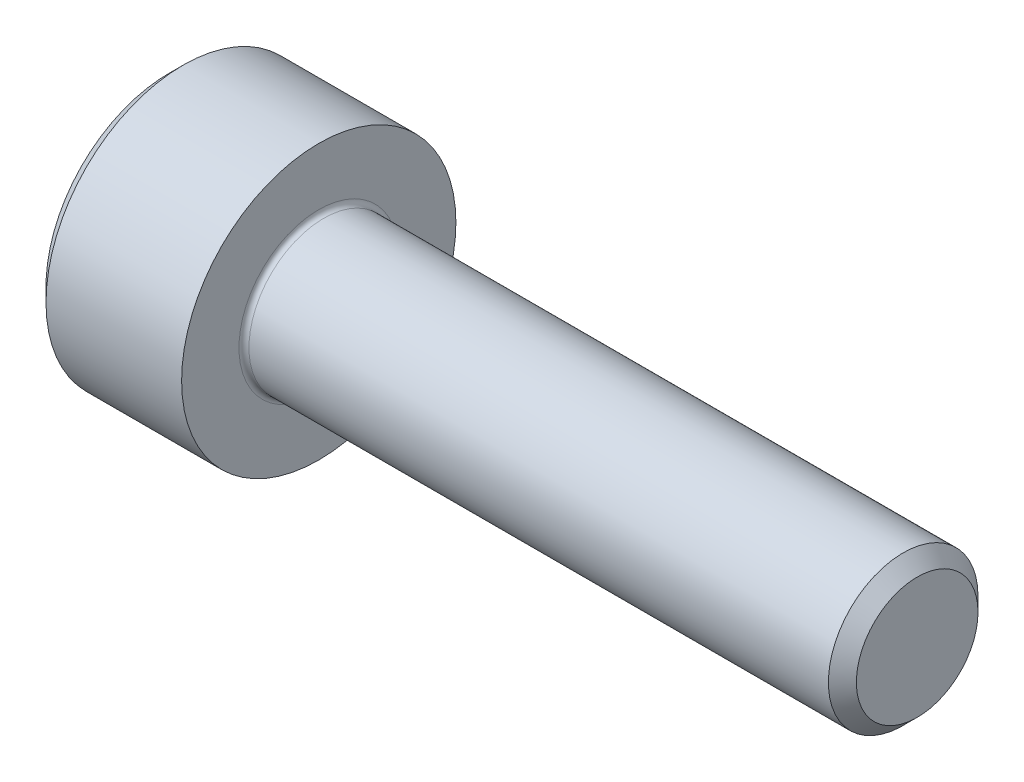
ISO-10303-21;
HEADER;
FILE_DESCRIPTION(('STEP AP214'),'2;1');
FILE_NAME('part.step','',(''),(''),'','','');
FILE_SCHEMA(('AUTOMOTIVE_DESIGN { 1 0 10303 214 1 1 1 1 }'));
ENDSEC;
DATA;
#1=APPLICATION_CONTEXT('core data for automotive mechanical design processes');
#2=APPLICATION_PROTOCOL_DEFINITION('international standard','automotive_design',2000,#1);
#3=PRODUCT_CONTEXT('',#1,'mechanical');
#4=PRODUCT('Part','Part','',(#3));
#5=PRODUCT_RELATED_PRODUCT_CATEGORY('part','',(#4));
#6=PRODUCT_DEFINITION_FORMATION('','',#4);
#7=PRODUCT_DEFINITION_CONTEXT('part definition',#1,'design');
#8=PRODUCT_DEFINITION('design','',#6,#7);
#9=PRODUCT_DEFINITION_SHAPE('','',#8);
#10=(LENGTH_UNIT() NAMED_UNIT(*) SI_UNIT(.MILLI.,.METRE.));
#11=(NAMED_UNIT(*) PLANE_ANGLE_UNIT() SI_UNIT($,.RADIAN.));
#12=(NAMED_UNIT(*) SI_UNIT($,.STERADIAN.) SOLID_ANGLE_UNIT());
#13=UNCERTAINTY_MEASURE_WITH_UNIT(LENGTH_MEASURE(1.E-05),#10,'distance_accuracy_value','');
#14=(GEOMETRIC_REPRESENTATION_CONTEXT(3) GLOBAL_UNCERTAINTY_ASSIGNED_CONTEXT((#13)) GLOBAL_UNIT_ASSIGNED_CONTEXT((#10,
#11,#12)) REPRESENTATION_CONTEXT('',''));
#15=CARTESIAN_POINT('',(0.,0.,0.));
#16=DIRECTION('',(0.,0.,1.));
#17=DIRECTION('',(1.,0.,0.));
#18=AXIS2_PLACEMENT_3D('',#15,#16,#17);
#19=CARTESIAN_POINT('',(1.3,0.,0.));
#20=DIRECTION('',(-1.,0.,0.));
#21=DIRECTION('',(0.,0.,1.));
#22=AXIS2_PLACEMENT_3D('',#19,#20,#21);
#23=PLANE('',#22);
#24=DIRECTION('',(0.,-1.,0.));
#25=VECTOR('',#24,1.);
#26=CARTESIAN_POINT('',(1.3,0.739008344562716,-1.28));
#27=LINE('',#26,#25);
#28=CARTESIAN_POINT('',(1.3,0.739008344562716,-1.28));
#29=VERTEX_POINT('',#28);
#30=CARTESIAN_POINT('',(1.3,0.,-1.28));
#31=VERTEX_POINT('',#30);
#32=EDGE_CURVE('E234',#29,#31,#27,.T.);
#33=ORIENTED_EDGE('',*,*,#32,.T.);
#34=CARTESIAN_POINT('',(1.3,0.,0.));
#35=DIRECTION('',(1.,0.,0.));
#36=DIRECTION('',(0.,0.,-1.));
#37=AXIS2_PLACEMENT_3D('',#34,#35,#36);
#38=CIRCLE('',#37,1.28);
#39=CARTESIAN_POINT('',(1.3,1.10851251684408,-0.640000000000004));
#40=VERTEX_POINT('',#39);
#41=EDGE_CURVE('E63',#31,#40,#38,.T.);
#42=ORIENTED_EDGE('',*,*,#41,.T.);
#43=DIRECTION('',(0.,-0.500000000000003,-0.866025403784437));
#44=VECTOR('',#43,1.);
#45=CARTESIAN_POINT('',(1.3,1.47801668912544,0.));
#46=LINE('',#45,#44);
#47=EDGE_CURVE('E278',#40,#29,#46,.T.);
#48=ORIENTED_EDGE('',*,*,#47,.T.);
#49=EDGE_LOOP('',(#33,#42,#48));
#50=FACE_BOUND('',#49,.T.);
#51=ADVANCED_FACE('F47',(#50),#23,.T.);
#52=CARTESIAN_POINT('',(1.3,1.47801668912544,0.));
#53=VERTEX_POINT('',#52);
#54=EDGE_CURVE('E274',#53,#40,#46,.T.);
#55=ORIENTED_EDGE('',*,*,#54,.T.);
#56=CARTESIAN_POINT('',(1.3,1.10851251684408,0.639999999999998));
#57=VERTEX_POINT('',#56);
#58=EDGE_CURVE('E223',#40,#57,#38,.T.);
#59=ORIENTED_EDGE('',*,*,#58,.T.);
#60=DIRECTION('',(0.,0.499999999999998,-0.86602540378444));
#61=VECTOR('',#60,1.);
#62=CARTESIAN_POINT('',(1.3,0.73900834456272,1.28));
#63=LINE('',#62,#61);
#64=EDGE_CURVE('E283',#57,#53,#63,.T.);
#65=ORIENTED_EDGE('',*,*,#64,.T.);
#66=EDGE_LOOP('',(#55,#59,#65));
#67=FACE_BOUND('',#66,.T.);
#68=ADVANCED_FACE('F139',(#67),#23,.T.);
#69=CARTESIAN_POINT('',(1.3,0.73900834456272,1.28));
#70=VERTEX_POINT('',#69);
#71=EDGE_CURVE('E279',#70,#57,#63,.T.);
#72=ORIENTED_EDGE('',*,*,#71,.T.);
#73=CARTESIAN_POINT('',(1.3,0.,1.28));
#74=VERTEX_POINT('',#73);
#75=EDGE_CURVE('E302',#57,#74,#38,.T.);
#76=ORIENTED_EDGE('',*,*,#75,.T.);
#77=DIRECTION('',(0.,1.,0.));
#78=VECTOR('',#77,1.);
#79=CARTESIAN_POINT('',(1.3,-0.739008344562722,1.28));
#80=LINE('',#79,#78);
#81=EDGE_CURVE('E288',#74,#70,#80,.T.);
#82=ORIENTED_EDGE('',*,*,#81,.T.);
#83=EDGE_LOOP('',(#72,#76,#82));
#84=FACE_BOUND('',#83,.T.);
#85=ADVANCED_FACE('F144',(#84),#23,.T.);
#86=CARTESIAN_POINT('',(1.3,-0.739008344562722,1.28));
#87=VERTEX_POINT('',#86);
#88=EDGE_CURVE('E284',#87,#74,#80,.T.);
#89=ORIENTED_EDGE('',*,*,#88,.T.);
#90=CARTESIAN_POINT('',(1.3,-1.10851251684408,0.640000000000001));
#91=VERTEX_POINT('',#90);
#92=EDGE_CURVE('E308',#74,#91,#38,.T.);
#93=ORIENTED_EDGE('',*,*,#92,.T.);
#94=DIRECTION('',(0.,0.5,0.866025403784438));
#95=VECTOR('',#94,1.);
#96=CARTESIAN_POINT('',(1.3,-1.47801668912544,0.));
#97=LINE('',#96,#95);
#98=EDGE_CURVE('E293',#91,#87,#97,.T.);
#99=ORIENTED_EDGE('',*,*,#98,.T.);
#100=EDGE_LOOP('',(#89,#93,#99));
#101=FACE_BOUND('',#100,.T.);
#102=ADVANCED_FACE('F323',(#101),#23,.T.);
#103=CARTESIAN_POINT('',(1.3,-1.47801668912544,0.));
#104=VERTEX_POINT('',#103);
#105=EDGE_CURVE('E289',#104,#91,#97,.T.);
#106=ORIENTED_EDGE('',*,*,#105,.T.);
#107=CARTESIAN_POINT('',(1.3,-1.10851251684408,-0.639999999999998));
#108=VERTEX_POINT('',#107);
#109=EDGE_CURVE('E304',#91,#108,#38,.T.);
#110=ORIENTED_EDGE('',*,*,#109,.T.);
#111=DIRECTION('',(0.,-0.499999999999999,0.86602540378444));
#112=VECTOR('',#111,1.);
#113=CARTESIAN_POINT('',(1.3,-0.739008344562726,-1.28));
#114=LINE('',#113,#112);
#115=EDGE_CURVE('E252',#108,#104,#114,.T.);
#116=ORIENTED_EDGE('',*,*,#115,.T.);
#117=EDGE_LOOP('',(#106,#110,#116));
#118=FACE_BOUND('',#117,.T.);
#119=ADVANCED_FACE('F137',(#118),#23,.T.);
#120=CARTESIAN_POINT('',(3.,0.,0.));
#121=DIRECTION('',(-1.,0.,0.));
#122=DIRECTION('',(0.,0.,1.));
#123=AXIS2_PLACEMENT_3D('',#120,#121,#122);
#124=CYLINDRICAL_SURFACE('',#123,2.75);
#125=CARTESIAN_POINT('',(0.28050000000001,0.,0.));
#126=DIRECTION('',(1.,0.,0.));
#127=DIRECTION('',(0.,0.,-1.));
#128=AXIS2_PLACEMENT_3D('',#125,#126,#127);
#129=CIRCLE('',#128,2.75);
#130=CARTESIAN_POINT('',(0.28050000000001,0.,-2.75));
#131=VERTEX_POINT('',#130);
#132=EDGE_CURVE('E206',#131,#131,#129,.T.);
#133=ORIENTED_EDGE('',*,*,#132,.T.);
#134=EDGE_LOOP('',(#133));
#135=FACE_BOUND('',#134,.T.);
#136=CARTESIAN_POINT('',(3.,0.,0.));
#137=DIRECTION('',(-1.,0.,0.));
#138=DIRECTION('',(0.,0.,-1.));
#139=AXIS2_PLACEMENT_3D('',#136,#137,#138);
#140=CIRCLE('',#139,2.75);
#141=CARTESIAN_POINT('',(3.,0.,-2.75));
#142=VERTEX_POINT('',#141);
#143=EDGE_CURVE('E224',#142,#142,#140,.T.);
#144=ORIENTED_EDGE('',*,*,#143,.T.);
#145=EDGE_LOOP('',(#144));
#146=FACE_BOUND('',#145,.T.);
#147=ADVANCED_FACE('F174',(#135,#146),#124,.T.);
#148=CARTESIAN_POINT('',(3.,0.,0.));
#149=DIRECTION('',(1.,0.,0.));
#150=DIRECTION('',(0.,0.,-1.));
#151=AXIS2_PLACEMENT_3D('',#148,#149,#150);
#152=PLANE('',#151);
#153=CARTESIAN_POINT('',(3.,0.,0.));
#154=DIRECTION('',(1.,0.,0.));
#155=DIRECTION('',(0.,0.,-1.));
#156=AXIS2_PLACEMENT_3D('',#153,#154,#155);
#157=CIRCLE('',#156,1.6);
#158=CARTESIAN_POINT('',(3.,0.,-1.6));
#159=VERTEX_POINT('',#158);
#160=EDGE_CURVE('E11',#159,#159,#157,.F.);
#161=ORIENTED_EDGE('',*,*,#160,.T.);
#162=EDGE_LOOP('',(#161));
#163=FACE_BOUND('',#162,.T.);
#164=ORIENTED_EDGE('',*,*,#143,.F.);
#165=EDGE_LOOP('',(#164));
#166=FACE_BOUND('',#165,.T.);
#167=ADVANCED_FACE('F171',(#163,#166),#152,.T.);
#168=CARTESIAN_POINT('',(0.,0.,0.));
#169=DIRECTION('',(1.,0.,0.));
#170=DIRECTION('',(0.,0.,-1.));
#171=AXIS2_PLACEMENT_3D('',#168,#169,#170);
#172=PLANE('',#171);
#173=CARTESIAN_POINT('',(0.,0.,0.));
#174=DIRECTION('',(1.,0.,0.));
#175=DIRECTION('',(0.,0.,-1.));
#176=AXIS2_PLACEMENT_3D('',#173,#174,#175);
#177=CIRCLE('',#176,2.4695);
#178=CARTESIAN_POINT('',(0.,0.,-2.4695));
#179=VERTEX_POINT('',#178);
#180=EDGE_CURVE('E212',#179,#179,#177,.F.);
#181=ORIENTED_EDGE('',*,*,#180,.T.);
#182=EDGE_LOOP('',(#181));
#183=FACE_BOUND('',#182,.T.);
#184=DIRECTION('',(0.,0.5,0.866025403784438));
#185=VECTOR('',#184,1.);
#186=CARTESIAN_POINT('',(0.,-1.47801668912544,0.));
#187=LINE('',#186,#185);
#188=CARTESIAN_POINT('',(0.,-1.47801668912544,0.));
#189=VERTEX_POINT('',#188);
#190=CARTESIAN_POINT('',(0.,-0.739008344562722,1.28));
#191=VERTEX_POINT('',#190);
#192=EDGE_CURVE('E265',#189,#191,#187,.T.);
#193=ORIENTED_EDGE('',*,*,#192,.F.);
#194=DIRECTION('',(0.,-0.499999999999999,0.86602540378444));
#195=VECTOR('',#194,1.);
#196=CARTESIAN_POINT('',(0.,-0.739008344562726,-1.28));
#197=LINE('',#196,#195);
#198=CARTESIAN_POINT('',(0.,-0.739008344562726,-1.28));
#199=VERTEX_POINT('',#198);
#200=EDGE_CURVE('E71',#199,#189,#197,.T.);
#201=ORIENTED_EDGE('',*,*,#200,.F.);
#202=DIRECTION('',(0.,-1.,0.));
#203=VECTOR('',#202,1.);
#204=CARTESIAN_POINT('',(0.,0.739008344562716,-1.28));
#205=LINE('',#204,#203);
#206=CARTESIAN_POINT('',(0.,0.739008344562716,-1.28));
#207=VERTEX_POINT('',#206);
#208=EDGE_CURVE('E248',#207,#199,#205,.T.);
#209=ORIENTED_EDGE('',*,*,#208,.F.);
#210=DIRECTION('',(0.,-0.500000000000003,-0.866025403784437));
#211=VECTOR('',#210,1.);
#212=CARTESIAN_POINT('',(0.,1.47801668912544,0.));
#213=LINE('',#212,#211);
#214=CARTESIAN_POINT('',(0.,1.47801668912544,0.));
#215=VERTEX_POINT('',#214);
#216=EDGE_CURVE('E253',#215,#207,#213,.T.);
#217=ORIENTED_EDGE('',*,*,#216,.F.);
#218=DIRECTION('',(0.,0.499999999999998,-0.86602540378444));
#219=VECTOR('',#218,1.);
#220=CARTESIAN_POINT('',(0.,0.73900834456272,1.28));
#221=LINE('',#220,#219);
#222=CARTESIAN_POINT('',(0.,0.73900834456272,1.28));
#223=VERTEX_POINT('',#222);
#224=EDGE_CURVE('E257',#223,#215,#221,.T.);
#225=ORIENTED_EDGE('',*,*,#224,.F.);
#226=DIRECTION('',(0.,1.,0.));
#227=VECTOR('',#226,1.);
#228=CARTESIAN_POINT('',(0.,-0.739008344562722,1.28));
#229=LINE('',#228,#227);
#230=EDGE_CURVE('E261',#191,#223,#229,.T.);
#231=ORIENTED_EDGE('',*,*,#230,.F.);
#232=EDGE_LOOP('',(#193,#201,#209,#217,#225,#231));
#233=FACE_BOUND('',#232,.T.);
#234=ADVANCED_FACE('F170',(#183,#233),#172,.F.);
#235=CARTESIAN_POINT('',(1.3,-0.739008344562726,-1.28));
#236=DIRECTION('',(0.,-0.86602540378444,-0.499999999999999));
#237=DIRECTION('',(0.,0.499999999999999,-0.86602540378444));
#238=AXIS2_PLACEMENT_3D('',#235,#236,#237);
#239=PLANE('',#238);
#240=ORIENTED_EDGE('',*,*,#200,.T.);
#241=DIRECTION('',(-1.,0.,0.));
#242=VECTOR('',#241,1.);
#243=CARTESIAN_POINT('',(1.3,-1.47801668912544,0.));
#244=LINE('',#243,#242);
#245=EDGE_CURVE('E230',#104,#189,#244,.T.);
#246=ORIENTED_EDGE('',*,*,#245,.F.);
#247=ORIENTED_EDGE('',*,*,#115,.F.);
#248=CARTESIAN_POINT('',(1.3,-0.739008344562726,-1.28));
#249=VERTEX_POINT('',#248);
#250=EDGE_CURVE('E294',#249,#108,#114,.T.);
#251=ORIENTED_EDGE('',*,*,#250,.F.);
#252=DIRECTION('',(-1.,0.,0.));
#253=VECTOR('',#252,1.);
#254=CARTESIAN_POINT('',(1.3,-0.739008344562726,-1.28));
#255=LINE('',#254,#253);
#256=EDGE_CURVE('E229',#249,#199,#255,.T.);
#257=ORIENTED_EDGE('',*,*,#256,.T.);
#258=EDGE_LOOP('',(#240,#246,#247,#251,#257));
#259=FACE_BOUND('',#258,.T.);
#260=ADVANCED_FACE('F152',(#259),#239,.F.);
#261=CARTESIAN_POINT('',(1.3,0.739008344562716,-1.28));
#262=DIRECTION('',(0.,0.,-1.));
#263=DIRECTION('',(-1.,0.,0.));
#264=AXIS2_PLACEMENT_3D('',#261,#262,#263);
#265=PLANE('',#264);
#266=ORIENTED_EDGE('',*,*,#208,.T.);
#267=ORIENTED_EDGE('',*,*,#256,.F.);
#268=EDGE_CURVE('E273',#31,#249,#27,.T.);
#269=ORIENTED_EDGE('',*,*,#268,.F.);
#270=ORIENTED_EDGE('',*,*,#32,.F.);
#271=DIRECTION('',(-1.,0.,0.));
#272=VECTOR('',#271,1.);
#273=CARTESIAN_POINT('',(1.3,0.739008344562716,-1.28));
#274=LINE('',#273,#272);
#275=EDGE_CURVE('E243',#29,#207,#274,.T.);
#276=ORIENTED_EDGE('',*,*,#275,.T.);
#277=EDGE_LOOP('',(#266,#267,#269,#270,#276));
#278=FACE_BOUND('',#277,.T.);
#279=ADVANCED_FACE('F148',(#278),#265,.F.);
#280=CARTESIAN_POINT('',(1.3,1.47801668912544,0.));
#281=DIRECTION('',(0.,0.866025403784437,-0.500000000000003));
#282=DIRECTION('',(0.,0.500000000000003,0.866025403784437));
#283=AXIS2_PLACEMENT_3D('',#280,#281,#282);
#284=PLANE('',#283);
#285=ORIENTED_EDGE('',*,*,#216,.T.);
#286=ORIENTED_EDGE('',*,*,#275,.F.);
#287=ORIENTED_EDGE('',*,*,#47,.F.);
#288=ORIENTED_EDGE('',*,*,#54,.F.);
#289=DIRECTION('',(-1.,0.,0.));
#290=VECTOR('',#289,1.);
#291=CARTESIAN_POINT('',(1.3,1.47801668912544,0.));
#292=LINE('',#291,#290);
#293=EDGE_CURVE('E240',#53,#215,#292,.T.);
#294=ORIENTED_EDGE('',*,*,#293,.T.);
#295=EDGE_LOOP('',(#285,#286,#287,#288,#294));
#296=FACE_BOUND('',#295,.T.);
#297=ADVANCED_FACE('F151',(#296),#284,.F.);
#298=CARTESIAN_POINT('',(1.3,0.73900834456272,1.28));
#299=DIRECTION('',(0.,0.86602540378444,0.499999999999998));
#300=DIRECTION('',(0.,-0.499999999999998,0.86602540378444));
#301=AXIS2_PLACEMENT_3D('',#298,#299,#300);
#302=PLANE('',#301);
#303=ORIENTED_EDGE('',*,*,#224,.T.);
#304=ORIENTED_EDGE('',*,*,#293,.F.);
#305=ORIENTED_EDGE('',*,*,#64,.F.);
#306=ORIENTED_EDGE('',*,*,#71,.F.);
#307=DIRECTION('',(-1.,0.,0.));
#308=VECTOR('',#307,1.);
#309=CARTESIAN_POINT('',(1.3,0.73900834456272,1.28));
#310=LINE('',#309,#308);
#311=EDGE_CURVE('E237',#70,#223,#310,.T.);
#312=ORIENTED_EDGE('',*,*,#311,.T.);
#313=EDGE_LOOP('',(#303,#304,#305,#306,#312));
#314=FACE_BOUND('',#313,.T.);
#315=ADVANCED_FACE('F156',(#314),#302,.F.);
#316=CARTESIAN_POINT('',(1.3,-0.739008344562722,1.28));
#317=DIRECTION('',(0.,0.,1.));
#318=DIRECTION('',(1.,0.,0.));
#319=AXIS2_PLACEMENT_3D('',#316,#317,#318);
#320=PLANE('',#319);
#321=ORIENTED_EDGE('',*,*,#230,.T.);
#322=ORIENTED_EDGE('',*,*,#311,.F.);
#323=ORIENTED_EDGE('',*,*,#81,.F.);
#324=ORIENTED_EDGE('',*,*,#88,.F.);
#325=DIRECTION('',(-1.,0.,0.));
#326=VECTOR('',#325,1.);
#327=CARTESIAN_POINT('',(1.3,-0.739008344562722,1.28));
#328=LINE('',#327,#326);
#329=EDGE_CURVE('E233',#87,#191,#328,.T.);
#330=ORIENTED_EDGE('',*,*,#329,.T.);
#331=EDGE_LOOP('',(#321,#322,#323,#324,#330));
#332=FACE_BOUND('',#331,.T.);
#333=ADVANCED_FACE('F160',(#332),#320,.F.);
#334=CARTESIAN_POINT('',(1.3,-1.47801668912544,0.));
#335=DIRECTION('',(0.,-0.866025403784438,0.500000000000001));
#336=DIRECTION('',(0.,-0.500000000000001,-0.866025403784438));
#337=AXIS2_PLACEMENT_3D('',#334,#335,#336);
#338=PLANE('',#337);
#339=ORIENTED_EDGE('',*,*,#192,.T.);
#340=ORIENTED_EDGE('',*,*,#329,.F.);
#341=ORIENTED_EDGE('',*,*,#98,.F.);
#342=ORIENTED_EDGE('',*,*,#105,.F.);
#343=ORIENTED_EDGE('',*,*,#245,.T.);
#344=EDGE_LOOP('',(#339,#340,#341,#342,#343));
#345=FACE_BOUND('',#344,.T.);
#346=ADVANCED_FACE('F134',(#345),#338,.F.);
#347=ORIENTED_EDGE('',*,*,#250,.T.);
#348=EDGE_CURVE('E228',#108,#31,#38,.T.);
#349=ORIENTED_EDGE('',*,*,#348,.T.);
#350=ORIENTED_EDGE('',*,*,#268,.T.);
#351=EDGE_LOOP('',(#347,#349,#350));
#352=FACE_BOUND('',#351,.T.);
#353=ADVANCED_FACE('F124',(#352),#23,.T.);
#354=CARTESIAN_POINT('',(2.03900834456272,0.,0.));
#355=DIRECTION('',(-1.,0.,0.));
#356=DIRECTION('',(0.,0.,1.));
#357=AXIS2_PLACEMENT_3D('',#354,#355,#356);
#358=CONICAL_SURFACE('',#357,0.,1.0471975511966);
#359=ORIENTED_EDGE('',*,*,#41,.F.);
#360=ORIENTED_EDGE('',*,*,#348,.F.);
#361=ORIENTED_EDGE('',*,*,#109,.F.);
#362=ORIENTED_EDGE('',*,*,#92,.F.);
#363=ORIENTED_EDGE('',*,*,#75,.F.);
#364=ORIENTED_EDGE('',*,*,#58,.F.);
#365=EDGE_LOOP('',(#359,#360,#361,#362,#363,#364));
#366=FACE_BOUND('',#365,.T.);
#367=CARTESIAN_POINT('',(2.03900834456272,0.,0.));
#368=VERTEX_POINT('',#367);
#369=VERTEX_LOOP('',#368);
#370=FACE_BOUND('',#369,.T.);
#371=ADVANCED_FACE('F121',(#366,#370),#358,.F.);
#372=CARTESIAN_POINT('',(15.,0.,0.));
#373=DIRECTION('',(-1.,0.,0.));
#374=DIRECTION('',(0.,0.,1.));
#375=AXIS2_PLACEMENT_3D('',#372,#373,#374);
#376=CYLINDRICAL_SURFACE('',#375,1.5);
#377=CARTESIAN_POINT('',(3.1,0.,0.));
#378=DIRECTION('',(1.,0.,0.));
#379=DIRECTION('',(0.,0.,-1.));
#380=AXIS2_PLACEMENT_3D('',#377,#378,#379);
#381=CIRCLE('',#380,1.5);
#382=CARTESIAN_POINT('',(3.1,0.,-1.5));
#383=VERTEX_POINT('',#382);
#384=EDGE_CURVE('E56',#383,#383,#381,.T.);
#385=ORIENTED_EDGE('',*,*,#384,.T.);
#386=EDGE_LOOP('',(#385));
#387=FACE_BOUND('',#386,.T.);
#388=CARTESIAN_POINT('',(14.7195,0.,0.));
#389=DIRECTION('',(1.,0.,0.));
#390=DIRECTION('',(0.,0.,-1.));
#391=AXIS2_PLACEMENT_3D('',#388,#389,#390);
#392=CIRCLE('',#391,1.5);
#393=CARTESIAN_POINT('',(14.7195,0.,-1.5));
#394=VERTEX_POINT('',#393);
#395=EDGE_CURVE('E200',#394,#394,#392,.F.);
#396=ORIENTED_EDGE('',*,*,#395,.T.);
#397=EDGE_LOOP('',(#396));
#398=FACE_BOUND('',#397,.T.);
#399=ADVANCED_FACE('F123',(#387,#398),#376,.T.);
#400=CARTESIAN_POINT('',(15.,0.,0.));
#401=DIRECTION('',(1.,0.,0.));
#402=DIRECTION('',(0.,0.,-1.));
#403=AXIS2_PLACEMENT_3D('',#400,#401,#402);
#404=PLANE('',#403);
#405=CARTESIAN_POINT('',(15.,0.,0.));
#406=DIRECTION('',(1.,0.,0.));
#407=DIRECTION('',(0.,0.,-1.));
#408=AXIS2_PLACEMENT_3D('',#405,#406,#407);
#409=CIRCLE('',#408,1.21950000000001);
#410=CARTESIAN_POINT('',(15.,0.,-1.21950000000001));
#411=VERTEX_POINT('',#410);
#412=EDGE_CURVE('E203',#411,#411,#409,.T.);
#413=ORIENTED_EDGE('',*,*,#412,.T.);
#414=EDGE_LOOP('',(#413));
#415=FACE_BOUND('',#414,.T.);
#416=ADVANCED_FACE('F131',(#415),#404,.T.);
#417=CARTESIAN_POINT('',(0.,0.,0.));
#418=DIRECTION('',(1.,0.,0.));
#419=DIRECTION('',(0.,0.,-1.));
#420=AXIS2_PLACEMENT_3D('',#417,#418,#419);
#421=CONICAL_SURFACE('',#420,2.4695,0.785398163397422);
#422=ORIENTED_EDGE('',*,*,#132,.F.);
#423=EDGE_LOOP('',(#422));
#424=FACE_BOUND('',#423,.T.);
#425=ORIENTED_EDGE('',*,*,#180,.F.);
#426=EDGE_LOOP('',(#425));
#427=FACE_BOUND('',#426,.T.);
#428=ADVANCED_FACE('F182',(#424,#427),#421,.T.);
#429=CARTESIAN_POINT('',(15.,0.,0.));
#430=DIRECTION('',(-1.,0.,0.));
#431=DIRECTION('',(0.,0.,1.));
#432=AXIS2_PLACEMENT_3D('',#429,#430,#431);
#433=CONICAL_SURFACE('',#432,1.21950000000001,0.785398163397421);
#434=ORIENTED_EDGE('',*,*,#395,.F.);
#435=EDGE_LOOP('',(#434));
#436=FACE_BOUND('',#435,.T.);
#437=ORIENTED_EDGE('',*,*,#412,.F.);
#438=EDGE_LOOP('',(#437));
#439=FACE_BOUND('',#438,.T.);
#440=ADVANCED_FACE('F187',(#436,#439),#433,.T.);
#441=CARTESIAN_POINT('',(3.1,0.,0.));
#442=DIRECTION('',(1.,0.,0.));
#443=DIRECTION('',(0.,0.,-1.));
#444=AXIS2_PLACEMENT_3D('',#441,#442,#443);
#445=TOROIDAL_SURFACE('',#444,1.6,0.1);
#446=ORIENTED_EDGE('',*,*,#160,.F.);
#447=EDGE_LOOP('',(#446));
#448=FACE_BOUND('',#447,.T.);
#449=ORIENTED_EDGE('',*,*,#384,.F.);
#450=EDGE_LOOP('',(#449));
#451=FACE_BOUND('',#450,.T.);
#452=ADVANCED_FACE('F49',(#448,#451),#445,.F.);
#453=CLOSED_SHELL('',(#51,#68,#85,#102,#119,#147,#167,#234,#260,#279,#297,#315,#333,#346,#353,
#371,#399,#416,#428,#440,#452));
#454=MANIFOLD_SOLID_BREP('B2',#453);
#455=ADVANCED_BREP_SHAPE_REPRESENTATION('',(#18,#454),#14);
#456=SHAPE_DEFINITION_REPRESENTATION(#9,#455);
ENDSEC;
END-ISO-10303-21;
